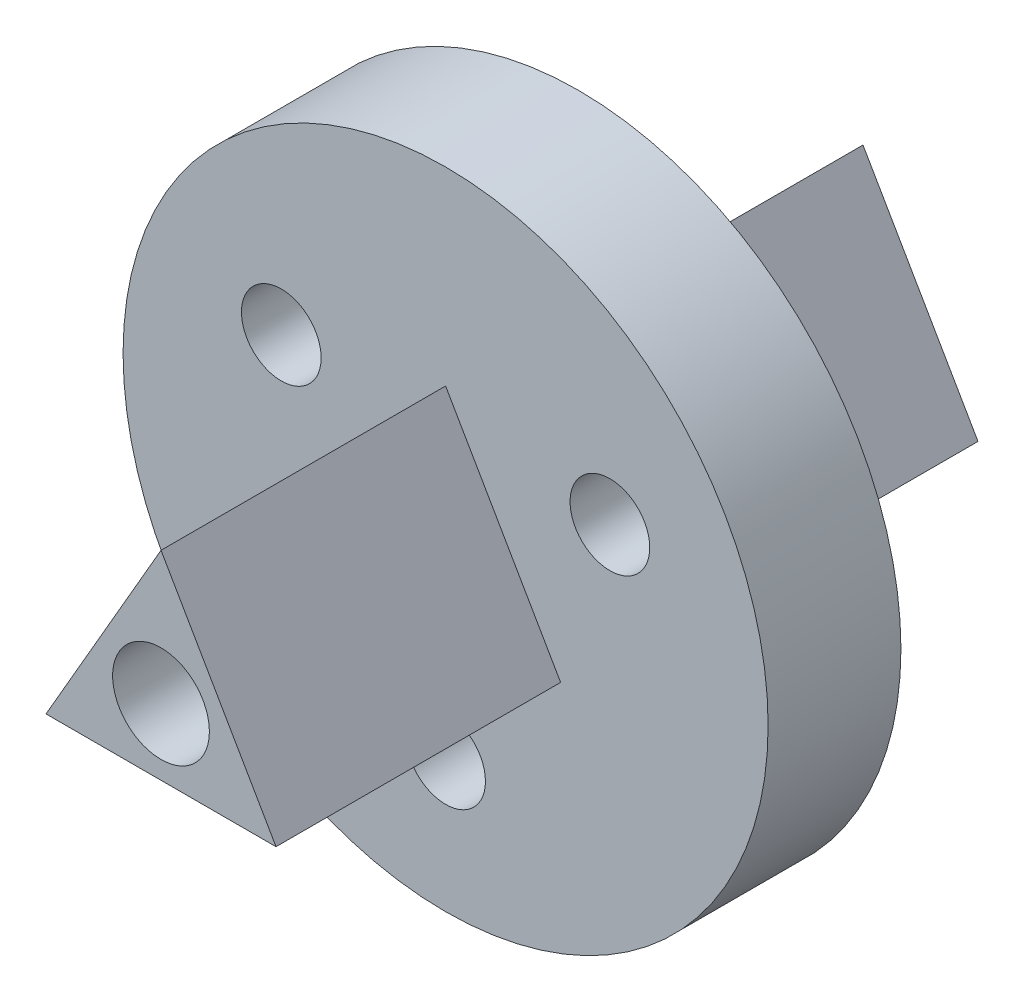
ISO-10303-21;
HEADER;
FILE_DESCRIPTION(('STEP AP214'),'2;1');
FILE_NAME('part.step','',(''),(''),'','','');
FILE_SCHEMA(('AUTOMOTIVE_DESIGN { 1 0 10303 214 1 1 1 1 }'));
ENDSEC;
DATA;
#1=APPLICATION_CONTEXT('core data for automotive mechanical design processes');
#2=APPLICATION_PROTOCOL_DEFINITION('international standard','automotive_design',2000,#1);
#3=PRODUCT_CONTEXT('',#1,'mechanical');
#4=PRODUCT('Part','Part','',(#3));
#5=PRODUCT_RELATED_PRODUCT_CATEGORY('part','',(#4));
#6=PRODUCT_DEFINITION_FORMATION('','',#4);
#7=PRODUCT_DEFINITION_CONTEXT('part definition',#1,'design');
#8=PRODUCT_DEFINITION('design','',#6,#7);
#9=PRODUCT_DEFINITION_SHAPE('','',#8);
#10=(LENGTH_UNIT() NAMED_UNIT(*) SI_UNIT(.MILLI.,.METRE.));
#11=(NAMED_UNIT(*) PLANE_ANGLE_UNIT() SI_UNIT($,.RADIAN.));
#12=(NAMED_UNIT(*) SI_UNIT($,.STERADIAN.) SOLID_ANGLE_UNIT());
#13=UNCERTAINTY_MEASURE_WITH_UNIT(LENGTH_MEASURE(1.E-05),#10,'distance_accuracy_value','');
#14=(GEOMETRIC_REPRESENTATION_CONTEXT(3) GLOBAL_UNCERTAINTY_ASSIGNED_CONTEXT((#13)) GLOBAL_UNIT_ASSIGNED_CONTEXT((#10,
#11,#12)) REPRESENTATION_CONTEXT('',''));
#15=CARTESIAN_POINT('',(0.,0.,0.));
#16=DIRECTION('',(0.,0.,1.));
#17=DIRECTION('',(1.,0.,0.));
#18=AXIS2_PLACEMENT_3D('',#15,#16,#17);
#19=CARTESIAN_POINT('',(0.,0.,7.));
#20=DIRECTION('',(0.,0.,1.));
#21=DIRECTION('',(1.,0.,0.));
#22=AXIS2_PLACEMENT_3D('',#19,#20,#21);
#23=PLANE('',#22);
#24=DIRECTION('',(-0.499999999999998,-0.86602540378444,0.));
#25=VECTOR('',#24,1.);
#26=CARTESIAN_POINT('',(-3.03108891324553,1.74999999999999,7.));
#27=LINE('',#26,#25);
#28=CARTESIAN_POINT('',(0.,7.,7.));
#29=VERTEX_POINT('',#28);
#30=CARTESIAN_POINT('',(-6.06217782649105,-3.50000000000003,7.));
#31=VERTEX_POINT('',#30);
#32=EDGE_CURVE('E47',#29,#31,#27,.T.);
#33=ORIENTED_EDGE('',*,*,#32,.F.);
#34=DIRECTION('',(-0.499999999999998,0.86602540378444,0.));
#35=VECTOR('',#34,1.);
#36=CARTESIAN_POINT('',(3.03108891324553,1.74999999999999,7.));
#37=LINE('',#36,#35);
#38=CARTESIAN_POINT('',(6.06217782649105,-3.50000000000003,7.));
#39=VERTEX_POINT('',#38);
#40=EDGE_CURVE('E130',#39,#29,#37,.T.);
#41=ORIENTED_EDGE('',*,*,#40,.F.);
#42=DIRECTION('',(1.,0.,0.));
#43=VECTOR('',#42,1.);
#44=CARTESIAN_POINT('',(0.,-3.50000000000003,7.));
#45=LINE('',#44,#43);
#46=EDGE_CURVE('E51',#31,#39,#45,.T.);
#47=ORIENTED_EDGE('',*,*,#46,.F.);
#48=EDGE_LOOP('',(#33,#41,#47));
#49=FACE_BOUND('',#48,.T.);
#50=CARTESIAN_POINT('',(4.8147646108211E-13,-10.0000000000003,7.));
#51=DIRECTION('',(0.,0.,1.));
#52=DIRECTION('',(1.,0.,0.));
#53=AXIS2_PLACEMENT_3D('',#50,#51,#52);
#54=CIRCLE('',#53,2.1);
#55=CARTESIAN_POINT('',(2.10000000000048,-10.0000000000003,7.));
#56=VERTEX_POINT('',#55);
#57=EDGE_CURVE('E140',#56,#56,#54,.T.);
#58=ORIENTED_EDGE('',*,*,#57,.F.);
#59=EDGE_LOOP('',(#58));
#60=FACE_BOUND('',#59,.T.);
#61=CARTESIAN_POINT('',(0.,0.,7.));
#62=DIRECTION('',(0.,0.,1.));
#63=DIRECTION('',(1.,0.,0.));
#64=AXIS2_PLACEMENT_3D('',#61,#62,#63);
#65=CIRCLE('',#64,17.);
#66=CARTESIAN_POINT('',(17.,0.,7.));
#67=VERTEX_POINT('',#66);
#68=EDGE_CURVE('E152',#67,#67,#65,.T.);
#69=ORIENTED_EDGE('',*,*,#68,.T.);
#70=EDGE_LOOP('',(#69));
#71=FACE_BOUND('',#70,.T.);
#72=CARTESIAN_POINT('',(8.6602540378444,4.99999999999998,7.));
#73=DIRECTION('',(0.,0.,1.));
#74=DIRECTION('',(1.,0.,0.));
#75=AXIS2_PLACEMENT_3D('',#72,#73,#74);
#76=CIRCLE('',#75,2.1);
#77=CARTESIAN_POINT('',(10.7602540378444,4.99999999999998,7.));
#78=VERTEX_POINT('',#77);
#79=EDGE_CURVE('E146',#78,#78,#76,.T.);
#80=ORIENTED_EDGE('',*,*,#79,.F.);
#81=EDGE_LOOP('',(#80));
#82=FACE_BOUND('',#81,.T.);
#83=CARTESIAN_POINT('',(-8.66025403784438,4.99999999999944,7.));
#84=DIRECTION('',(0.,0.,1.));
#85=DIRECTION('',(1.,0.,0.));
#86=AXIS2_PLACEMENT_3D('',#83,#84,#85);
#87=CIRCLE('',#86,2.1);
#88=CARTESIAN_POINT('',(-6.56025403784438,4.99999999999944,7.));
#89=VERTEX_POINT('',#88);
#90=EDGE_CURVE('E134',#89,#89,#87,.T.);
#91=ORIENTED_EDGE('',*,*,#90,.F.);
#92=EDGE_LOOP('',(#91));
#93=FACE_BOUND('',#92,.T.);
#94=ADVANCED_FACE('F32',(#49,#60,#71,#82,#93),#23,.T.);
#95=CARTESIAN_POINT('',(0.,0.,0.));
#96=DIRECTION('',(0.,0.,1.));
#97=DIRECTION('',(1.,0.,0.));
#98=AXIS2_PLACEMENT_3D('',#95,#96,#97);
#99=PLANE('',#98);
#100=DIRECTION('',(-0.499999999999998,0.86602540378444,0.));
#101=VECTOR('',#100,1.);
#102=CARTESIAN_POINT('',(3.03108891324553,1.74999999999999,0.));
#103=LINE('',#102,#101);
#104=CARTESIAN_POINT('',(6.06217782649105,-3.50000000000003,0.));
#105=VERTEX_POINT('',#104);
#106=CARTESIAN_POINT('',(0.,7.,0.));
#107=VERTEX_POINT('',#106);
#108=EDGE_CURVE('E40',#105,#107,#103,.T.);
#109=ORIENTED_EDGE('',*,*,#108,.T.);
#110=DIRECTION('',(-0.499999999999998,-0.86602540378444,0.));
#111=VECTOR('',#110,1.);
#112=CARTESIAN_POINT('',(-3.03108891324553,1.74999999999999,0.));
#113=LINE('',#112,#111);
#114=CARTESIAN_POINT('',(-6.06217782649105,-3.50000000000003,0.));
#115=VERTEX_POINT('',#114);
#116=EDGE_CURVE('E11',#107,#115,#113,.T.);
#117=ORIENTED_EDGE('',*,*,#116,.T.);
#118=DIRECTION('',(1.,0.,0.));
#119=VECTOR('',#118,1.);
#120=CARTESIAN_POINT('',(0.,-3.50000000000003,0.));
#121=LINE('',#120,#119);
#122=EDGE_CURVE('E155',#115,#105,#121,.T.);
#123=ORIENTED_EDGE('',*,*,#122,.T.);
#124=EDGE_LOOP('',(#109,#117,#123));
#125=FACE_BOUND('',#124,.T.);
#126=CARTESIAN_POINT('',(4.8147646108211E-13,-10.0000000000003,0.));
#127=DIRECTION('',(0.,0.,1.));
#128=DIRECTION('',(1.,0.,0.));
#129=AXIS2_PLACEMENT_3D('',#126,#127,#128);
#130=CIRCLE('',#129,2.1);
#131=CARTESIAN_POINT('',(2.10000000000048,-10.0000000000003,0.));
#132=VERTEX_POINT('',#131);
#133=EDGE_CURVE('E137',#132,#132,#130,.T.);
#134=ORIENTED_EDGE('',*,*,#133,.T.);
#135=EDGE_LOOP('',(#134));
#136=FACE_BOUND('',#135,.T.);
#137=CARTESIAN_POINT('',(0.,0.,0.));
#138=DIRECTION('',(0.,0.,1.));
#139=DIRECTION('',(1.,0.,0.));
#140=AXIS2_PLACEMENT_3D('',#137,#138,#139);
#141=CIRCLE('',#140,17.);
#142=CARTESIAN_POINT('',(17.,0.,0.));
#143=VERTEX_POINT('',#142);
#144=EDGE_CURVE('E149',#143,#143,#141,.T.);
#145=ORIENTED_EDGE('',*,*,#144,.F.);
#146=EDGE_LOOP('',(#145));
#147=FACE_BOUND('',#146,.T.);
#148=CARTESIAN_POINT('',(8.6602540378444,4.99999999999998,0.));
#149=DIRECTION('',(0.,0.,1.));
#150=DIRECTION('',(1.,0.,0.));
#151=AXIS2_PLACEMENT_3D('',#148,#149,#150);
#152=CIRCLE('',#151,2.1);
#153=CARTESIAN_POINT('',(10.7602540378444,4.99999999999998,0.));
#154=VERTEX_POINT('',#153);
#155=EDGE_CURVE('E143',#154,#154,#152,.T.);
#156=ORIENTED_EDGE('',*,*,#155,.T.);
#157=EDGE_LOOP('',(#156));
#158=FACE_BOUND('',#157,.T.);
#159=CARTESIAN_POINT('',(-8.66025403784438,4.99999999999944,0.));
#160=DIRECTION('',(0.,0.,1.));
#161=DIRECTION('',(1.,0.,0.));
#162=AXIS2_PLACEMENT_3D('',#159,#160,#161);
#163=CIRCLE('',#162,2.1);
#164=CARTESIAN_POINT('',(-6.56025403784438,4.99999999999944,0.));
#165=VERTEX_POINT('',#164);
#166=EDGE_CURVE('E133',#165,#165,#163,.T.);
#167=ORIENTED_EDGE('',*,*,#166,.T.);
#168=EDGE_LOOP('',(#167));
#169=FACE_BOUND('',#168,.T.);
#170=ADVANCED_FACE('F162',(#125,#136,#147,#158,#169),#99,.F.);
#171=CARTESIAN_POINT('',(0.,0.,7.));
#172=DIRECTION('',(0.,0.,-1.));
#173=DIRECTION('',(-1.,0.,0.));
#174=AXIS2_PLACEMENT_3D('',#171,#172,#173);
#175=CYLINDRICAL_SURFACE('',#174,17.);
#176=ORIENTED_EDGE('',*,*,#68,.F.);
#177=EDGE_LOOP('',(#176));
#178=FACE_BOUND('',#177,.T.);
#179=ORIENTED_EDGE('',*,*,#144,.T.);
#180=EDGE_LOOP('',(#179));
#181=FACE_BOUND('',#180,.T.);
#182=ADVANCED_FACE('F34',(#178,#181),#175,.T.);
#183=CARTESIAN_POINT('',(8.6602540378444,4.99999999999998,7.));
#184=DIRECTION('',(0.,0.,-1.));
#185=DIRECTION('',(-1.,0.,0.));
#186=AXIS2_PLACEMENT_3D('',#183,#184,#185);
#187=CYLINDRICAL_SURFACE('',#186,2.1);
#188=ORIENTED_EDGE('',*,*,#79,.T.);
#189=EDGE_LOOP('',(#188));
#190=FACE_BOUND('',#189,.T.);
#191=ORIENTED_EDGE('',*,*,#155,.F.);
#192=EDGE_LOOP('',(#191));
#193=FACE_BOUND('',#192,.T.);
#194=ADVANCED_FACE('F196',(#190,#193),#187,.F.);
#195=CARTESIAN_POINT('',(4.8147646108211E-13,-10.0000000000003,7.));
#196=DIRECTION('',(0.,0.,-1.));
#197=DIRECTION('',(-1.,0.,0.));
#198=AXIS2_PLACEMENT_3D('',#195,#196,#197);
#199=CYLINDRICAL_SURFACE('',#198,2.1);
#200=ORIENTED_EDGE('',*,*,#57,.T.);
#201=EDGE_LOOP('',(#200));
#202=FACE_BOUND('',#201,.T.);
#203=ORIENTED_EDGE('',*,*,#133,.F.);
#204=EDGE_LOOP('',(#203));
#205=FACE_BOUND('',#204,.T.);
#206=ADVANCED_FACE('F184',(#202,#205),#199,.F.);
#207=CARTESIAN_POINT('',(-8.66025403784438,4.99999999999944,7.));
#208=DIRECTION('',(0.,0.,-1.));
#209=DIRECTION('',(-1.,0.,0.));
#210=AXIS2_PLACEMENT_3D('',#207,#208,#209);
#211=CYLINDRICAL_SURFACE('',#210,2.1);
#212=ORIENTED_EDGE('',*,*,#90,.T.);
#213=EDGE_LOOP('',(#212));
#214=FACE_BOUND('',#213,.T.);
#215=ORIENTED_EDGE('',*,*,#166,.F.);
#216=EDGE_LOOP('',(#215));
#217=FACE_BOUND('',#216,.T.);
#218=ADVANCED_FACE('F176',(#214,#217),#211,.F.);
#219=CARTESIAN_POINT('',(6.06217782649105,-3.50000000000003,-15.));
#220=DIRECTION('',(0.,-1.,0.));
#221=DIRECTION('',(1.,0.,0.));
#222=AXIS2_PLACEMENT_3D('',#219,#220,#221);
#223=PLANE('',#222);
#224=ORIENTED_EDGE('',*,*,#122,.F.);
#225=DIRECTION('',(0.,0.,1.));
#226=VECTOR('',#225,1.);
#227=CARTESIAN_POINT('',(-6.06217782649105,-3.50000000000003,-15.));
#228=LINE('',#227,#226);
#229=CARTESIAN_POINT('',(-6.06217782649105,-3.50000000000003,-15.));
#230=VERTEX_POINT('',#229);
#231=EDGE_CURVE('E90',#230,#115,#228,.T.);
#232=ORIENTED_EDGE('',*,*,#231,.F.);
#233=DIRECTION('',(1.,0.,0.));
#234=VECTOR('',#233,1.);
#235=CARTESIAN_POINT('',(6.06217782649105,-3.50000000000003,-15.));
#236=LINE('',#235,#234);
#237=CARTESIAN_POINT('',(6.06217782649105,-3.50000000000003,-15.));
#238=VERTEX_POINT('',#237);
#239=EDGE_CURVE('E117',#230,#238,#236,.T.);
#240=ORIENTED_EDGE('',*,*,#239,.T.);
#241=DIRECTION('',(0.,0.,1.));
#242=VECTOR('',#241,1.);
#243=CARTESIAN_POINT('',(6.06217782649105,-3.50000000000003,-15.));
#244=LINE('',#243,#242);
#245=EDGE_CURVE('E126',#238,#105,#244,.T.);
#246=ORIENTED_EDGE('',*,*,#245,.T.);
#247=EDGE_LOOP('',(#224,#232,#240,#246));
#248=FACE_BOUND('',#247,.T.);
#249=ADVANCED_FACE('F174',(#248),#223,.T.);
#250=CARTESIAN_POINT('',(0.,7.,-15.));
#251=DIRECTION('',(0.86602540378444,0.499999999999998,0.));
#252=DIRECTION('',(-0.499999999999998,0.86602540378444,0.));
#253=AXIS2_PLACEMENT_3D('',#250,#251,#252);
#254=PLANE('',#253);
#255=ORIENTED_EDGE('',*,*,#108,.F.);
#256=ORIENTED_EDGE('',*,*,#245,.F.);
#257=DIRECTION('',(-0.499999999999998,0.86602540378444,0.));
#258=VECTOR('',#257,1.);
#259=CARTESIAN_POINT('',(0.,7.,-15.));
#260=LINE('',#259,#258);
#261=CARTESIAN_POINT('',(0.,7.,-15.));
#262=VERTEX_POINT('',#261);
#263=EDGE_CURVE('E91',#238,#262,#260,.T.);
#264=ORIENTED_EDGE('',*,*,#263,.T.);
#265=DIRECTION('',(0.,0.,1.));
#266=VECTOR('',#265,1.);
#267=CARTESIAN_POINT('',(0.,7.,-15.));
#268=LINE('',#267,#266);
#269=EDGE_CURVE('E122',#262,#107,#268,.T.);
#270=ORIENTED_EDGE('',*,*,#269,.T.);
#271=EDGE_LOOP('',(#255,#256,#264,#270));
#272=FACE_BOUND('',#271,.T.);
#273=ADVANCED_FACE('F165',(#272),#254,.T.);
#274=CARTESIAN_POINT('',(-6.06217782649105,-3.50000000000003,-15.));
#275=DIRECTION('',(-0.86602540378444,0.499999999999998,0.));
#276=DIRECTION('',(-0.499999999999998,-0.86602540378444,0.));
#277=AXIS2_PLACEMENT_3D('',#274,#275,#276);
#278=PLANE('',#277);
#279=ORIENTED_EDGE('',*,*,#116,.F.);
#280=ORIENTED_EDGE('',*,*,#269,.F.);
#281=DIRECTION('',(-0.499999999999998,-0.86602540378444,0.));
#282=VECTOR('',#281,1.);
#283=CARTESIAN_POINT('',(-6.06217782649105,-3.50000000000003,-15.));
#284=LINE('',#283,#282);
#285=EDGE_CURVE('E114',#262,#230,#284,.T.);
#286=ORIENTED_EDGE('',*,*,#285,.T.);
#287=ORIENTED_EDGE('',*,*,#231,.T.);
#288=EDGE_LOOP('',(#279,#280,#286,#287));
#289=FACE_BOUND('',#288,.T.);
#290=ADVANCED_FACE('F169',(#289),#278,.T.);
#291=CARTESIAN_POINT('',(0.,0.,-15.));
#292=DIRECTION('',(0.,0.,-1.));
#293=DIRECTION('',(-1.,0.,0.));
#294=AXIS2_PLACEMENT_3D('',#291,#292,#293);
#295=PLANE('',#294);
#296=CARTESIAN_POINT('',(0.,0.,-15.));
#297=DIRECTION('',(0.,0.,1.));
#298=DIRECTION('',(1.,0.,0.));
#299=AXIS2_PLACEMENT_3D('',#296,#297,#298);
#300=CIRCLE('',#299,2.55);
#301=CARTESIAN_POINT('',(2.55,0.,-15.));
#302=VERTEX_POINT('',#301);
#303=EDGE_CURVE('E111',#302,#302,#300,.T.);
#304=ORIENTED_EDGE('',*,*,#303,.T.);
#305=EDGE_LOOP('',(#304));
#306=FACE_BOUND('',#305,.T.);
#307=ORIENTED_EDGE('',*,*,#285,.F.);
#308=ORIENTED_EDGE('',*,*,#263,.F.);
#309=ORIENTED_EDGE('',*,*,#239,.F.);
#310=EDGE_LOOP('',(#307,#308,#309));
#311=FACE_BOUND('',#310,.T.);
#312=ADVANCED_FACE('F172',(#306,#311),#295,.T.);
#313=CARTESIAN_POINT('',(0.,0.,-15.));
#314=DIRECTION('',(0.,0.,1.));
#315=DIRECTION('',(1.,0.,0.));
#316=AXIS2_PLACEMENT_3D('',#313,#314,#315);
#317=CYLINDRICAL_SURFACE('',#316,2.55);
#318=ORIENTED_EDGE('',*,*,#303,.F.);
#319=EDGE_LOOP('',(#318));
#320=FACE_BOUND('',#319,.T.);
#321=CARTESIAN_POINT('',(0.,0.,22.));
#322=DIRECTION('',(0.,0.,1.));
#323=DIRECTION('',(1.,0.,0.));
#324=AXIS2_PLACEMENT_3D('',#321,#322,#323);
#325=CIRCLE('',#324,2.55);
#326=CARTESIAN_POINT('',(2.55,0.,22.));
#327=VERTEX_POINT('',#326);
#328=EDGE_CURVE('E105',#327,#327,#325,.T.);
#329=ORIENTED_EDGE('',*,*,#328,.T.);
#330=EDGE_LOOP('',(#329));
#331=FACE_BOUND('',#330,.T.);
#332=ADVANCED_FACE('F203',(#320,#331),#317,.F.);
#333=CARTESIAN_POINT('',(0.,7.,22.));
#334=VERTEX_POINT('',#333);
#335=EDGE_CURVE('E125',#29,#334,#268,.T.);
#336=ORIENTED_EDGE('',*,*,#335,.F.);
#337=ORIENTED_EDGE('',*,*,#32,.T.);
#338=CARTESIAN_POINT('',(-6.06217782649105,-3.50000000000003,22.));
#339=VERTEX_POINT('',#338);
#340=EDGE_CURVE('E83',#31,#339,#228,.T.);
#341=ORIENTED_EDGE('',*,*,#340,.T.);
#342=DIRECTION('',(-0.499999999999998,-0.86602540378444,0.));
#343=VECTOR('',#342,1.);
#344=CARTESIAN_POINT('',(-6.06217782649105,-3.50000000000003,22.));
#345=LINE('',#344,#343);
#346=EDGE_CURVE('E88',#334,#339,#345,.T.);
#347=ORIENTED_EDGE('',*,*,#346,.F.);
#348=EDGE_LOOP('',(#336,#337,#341,#347));
#349=FACE_BOUND('',#348,.T.);
#350=ADVANCED_FACE('F86',(#349),#278,.T.);
#351=CARTESIAN_POINT('',(6.06217782649105,-3.50000000000003,22.));
#352=VERTEX_POINT('',#351);
#353=EDGE_CURVE('E97',#39,#352,#244,.T.);
#354=ORIENTED_EDGE('',*,*,#353,.F.);
#355=ORIENTED_EDGE('',*,*,#40,.T.);
#356=ORIENTED_EDGE('',*,*,#335,.T.);
#357=DIRECTION('',(-0.499999999999998,0.86602540378444,0.));
#358=VECTOR('',#357,1.);
#359=CARTESIAN_POINT('',(0.,7.,22.));
#360=LINE('',#359,#358);
#361=EDGE_CURVE('E101',#352,#334,#360,.T.);
#362=ORIENTED_EDGE('',*,*,#361,.F.);
#363=EDGE_LOOP('',(#354,#355,#356,#362));
#364=FACE_BOUND('',#363,.T.);
#365=ADVANCED_FACE('F183',(#364),#254,.T.);
#366=ORIENTED_EDGE('',*,*,#340,.F.);
#367=ORIENTED_EDGE('',*,*,#46,.T.);
#368=ORIENTED_EDGE('',*,*,#353,.T.);
#369=DIRECTION('',(1.,0.,0.));
#370=VECTOR('',#369,1.);
#371=CARTESIAN_POINT('',(6.06217782649105,-3.50000000000003,22.));
#372=LINE('',#371,#370);
#373=EDGE_CURVE('E94',#339,#352,#372,.T.);
#374=ORIENTED_EDGE('',*,*,#373,.F.);
#375=EDGE_LOOP('',(#366,#367,#368,#374));
#376=FACE_BOUND('',#375,.T.);
#377=ADVANCED_FACE('F95',(#376),#223,.T.);
#378=CARTESIAN_POINT('',(0.,0.,22.));
#379=DIRECTION('',(0.,0.,-1.));
#380=DIRECTION('',(-1.,0.,0.));
#381=AXIS2_PLACEMENT_3D('',#378,#379,#380);
#382=PLANE('',#381);
#383=ORIENTED_EDGE('',*,*,#346,.T.);
#384=ORIENTED_EDGE('',*,*,#373,.T.);
#385=ORIENTED_EDGE('',*,*,#361,.T.);
#386=EDGE_LOOP('',(#383,#384,#385));
#387=FACE_BOUND('',#386,.T.);
#388=ORIENTED_EDGE('',*,*,#328,.F.);
#389=EDGE_LOOP('',(#388));
#390=FACE_BOUND('',#389,.T.);
#391=ADVANCED_FACE('F103',(#387,#390),#382,.F.);
#392=CLOSED_SHELL('',(#94,#170,#182,#194,#206,#218,#249,#273,#290,#312,#332,#350,#365,#377,#391));
#393=MANIFOLD_SOLID_BREP('B2',#392);
#394=ADVANCED_BREP_SHAPE_REPRESENTATION('',(#18,#393),#14);
#395=SHAPE_DEFINITION_REPRESENTATION(#9,#394);
ENDSEC;
END-ISO-10303-21;
